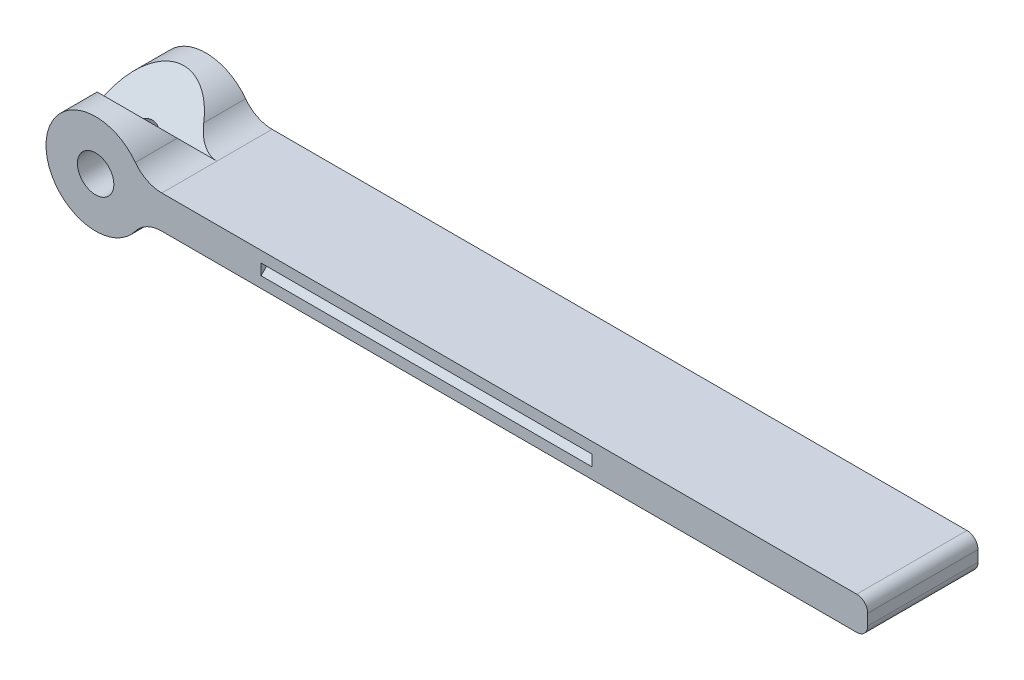
ISO-10303-21;
HEADER;
FILE_DESCRIPTION(('STEP AP214'),'2;1');
FILE_NAME('part.step','',(''),(''),'','','');
FILE_SCHEMA(('AUTOMOTIVE_DESIGN { 1 0 10303 214 1 1 1 1 }'));
ENDSEC;
DATA;
#1=APPLICATION_CONTEXT('core data for automotive mechanical design processes');
#2=APPLICATION_PROTOCOL_DEFINITION('international standard','automotive_design',2000,#1);
#3=PRODUCT_CONTEXT('',#1,'mechanical');
#4=PRODUCT('Part','Part','',(#3));
#5=PRODUCT_RELATED_PRODUCT_CATEGORY('part','',(#4));
#6=PRODUCT_DEFINITION_FORMATION('','',#4);
#7=PRODUCT_DEFINITION_CONTEXT('part definition',#1,'design');
#8=PRODUCT_DEFINITION('design','',#6,#7);
#9=PRODUCT_DEFINITION_SHAPE('','',#8);
#10=(LENGTH_UNIT() NAMED_UNIT(*) SI_UNIT(.MILLI.,.METRE.));
#11=(NAMED_UNIT(*) PLANE_ANGLE_UNIT() SI_UNIT($,.RADIAN.));
#12=(NAMED_UNIT(*) SI_UNIT($,.STERADIAN.) SOLID_ANGLE_UNIT());
#13=UNCERTAINTY_MEASURE_WITH_UNIT(LENGTH_MEASURE(1.E-05),#10,'distance_accuracy_value','');
#14=(GEOMETRIC_REPRESENTATION_CONTEXT(3) GLOBAL_UNCERTAINTY_ASSIGNED_CONTEXT((#13)) GLOBAL_UNIT_ASSIGNED_CONTEXT((#10,
#11,#12)) REPRESENTATION_CONTEXT('',''));
#15=CARTESIAN_POINT('',(0.,0.,0.));
#16=DIRECTION('',(0.,0.,1.));
#17=DIRECTION('',(1.,0.,0.));
#18=AXIS2_PLACEMENT_3D('',#15,#16,#17);
#19=CARTESIAN_POINT('',(-10.9373031220337,6.14016499259442,10.));
#20=DIRECTION('',(0.,0.,1.));
#21=DIRECTION('',(1.,0.,0.));
#22=AXIS2_PLACEMENT_3D('',#19,#20,#21);
#23=PLANE('',#22);
#24=CARTESIAN_POINT('',(-10.9373031220337,6.14016499259442,10.));
#25=DIRECTION('',(0.,0.,-1.));
#26=DIRECTION('',(1.,0.,0.));
#27=AXIS2_PLACEMENT_3D('',#24,#25,#26);
#28=CIRCLE('',#27,3.);
#29=CARTESIAN_POINT('',(-13.3373031220337,7.94016499259442,10.));
#30=VERTEX_POINT('',#29);
#31=CARTESIAN_POINT('',(-10.9373031220337,9.14016499259442,10.));
#32=VERTEX_POINT('',#31);
#33=EDGE_CURVE('E231',#30,#32,#28,.T.);
#34=ORIENTED_EDGE('',*,*,#33,.T.);
#35=DIRECTION('',(1.,0.,0.));
#36=VECTOR('',#35,1.);
#37=CARTESIAN_POINT('',(52.0626968779663,9.14016499259443,10.));
#38=LINE('',#37,#36);
#39=CARTESIAN_POINT('',(52.0626968779663,9.14016499259443,10.));
#40=VERTEX_POINT('',#39);
#41=EDGE_CURVE('E234',#32,#40,#38,.T.);
#42=ORIENTED_EDGE('',*,*,#41,.T.);
#43=CARTESIAN_POINT('',(52.0626968779663,10.1401649925944,10.));
#44=DIRECTION('',(0.,0.,1.));
#45=DIRECTION('',(1.,0.,0.));
#46=AXIS2_PLACEMENT_3D('',#43,#44,#45);
#47=CIRCLE('',#46,1.);
#48=CARTESIAN_POINT('',(53.0626968779663,10.1401649925944,10.));
#49=VERTEX_POINT('',#48);
#50=EDGE_CURVE('E237',#40,#49,#47,.T.);
#51=ORIENTED_EDGE('',*,*,#50,.T.);
#52=DIRECTION('',(0.,1.,0.));
#53=VECTOR('',#52,1.);
#54=CARTESIAN_POINT('',(53.0626968779663,11.1401649925944,10.));
#55=LINE('',#54,#53);
#56=CARTESIAN_POINT('',(53.0626968779663,11.1401649925944,10.));
#57=VERTEX_POINT('',#56);
#58=EDGE_CURVE('E239',#49,#57,#55,.T.);
#59=ORIENTED_EDGE('',*,*,#58,.T.);
#60=CARTESIAN_POINT('',(52.0626968779663,11.1401649925944,10.));
#61=DIRECTION('',(0.,0.,1.));
#62=DIRECTION('',(-1.,0.,0.));
#63=AXIS2_PLACEMENT_3D('',#60,#61,#62);
#64=CIRCLE('',#63,0.999999999999999);
#65=CARTESIAN_POINT('',(52.0626968779663,12.1401649925944,10.));
#66=VERTEX_POINT('',#65);
#67=EDGE_CURVE('E241',#57,#66,#64,.T.);
#68=ORIENTED_EDGE('',*,*,#67,.T.);
#69=DIRECTION('',(-1.,0.,0.));
#70=VECTOR('',#69,1.);
#71=CARTESIAN_POINT('',(-10.9373031220337,12.1401649925944,10.));
#72=LINE('',#71,#70);
#73=CARTESIAN_POINT('',(-10.9373031220337,12.1401649925944,10.));
#74=VERTEX_POINT('',#73);
#75=EDGE_CURVE('E243',#66,#74,#72,.T.);
#76=ORIENTED_EDGE('',*,*,#75,.T.);
#77=CARTESIAN_POINT('',(-10.9373031220337,15.1401649925944,10.));
#78=DIRECTION('',(0.,0.,-1.));
#79=DIRECTION('',(-1.,0.,0.));
#80=AXIS2_PLACEMENT_3D('',#77,#78,#79);
#81=CIRCLE('',#80,3.);
#82=CARTESIAN_POINT('',(-13.3373031220337,13.3401649925944,10.));
#83=VERTEX_POINT('',#82);
#84=EDGE_CURVE('E245',#74,#83,#81,.T.);
#85=ORIENTED_EDGE('',*,*,#84,.T.);
#86=CARTESIAN_POINT('',(-16.9373031220337,10.6401649925944,10.));
#87=DIRECTION('',(0.,0.,1.));
#88=DIRECTION('',(1.,0.,0.));
#89=AXIS2_PLACEMENT_3D('',#86,#87,#88);
#90=CIRCLE('',#89,4.5);
#91=EDGE_CURVE('E247',#83,#30,#90,.T.);
#92=ORIENTED_EDGE('',*,*,#91,.T.);
#93=EDGE_LOOP('',(#34,#42,#51,#59,#68,#76,#85,#92));
#94=FACE_BOUND('',#93,.T.);
#95=CARTESIAN_POINT('',(-16.9373031220337,10.6401649925944,10.));
#96=DIRECTION('',(0.,0.,1.));
#97=DIRECTION('',(1.,0.,0.));
#98=AXIS2_PLACEMENT_3D('',#95,#96,#97);
#99=CIRCLE('',#98,1.65);
#100=CARTESIAN_POINT('',(-15.2873031220337,10.6401649925944,10.));
#101=VERTEX_POINT('',#100);
#102=EDGE_CURVE('E225',#101,#101,#99,.T.);
#103=ORIENTED_EDGE('',*,*,#102,.F.);
#104=EDGE_LOOP('',(#103));
#105=FACE_BOUND('',#104,.T.);
#106=DIRECTION('',(1.,0.,0.));
#107=VECTOR('',#106,1.);
#108=CARTESIAN_POINT('',(-1.9373031220337,10.1401649925944,10.));
#109=LINE('',#108,#107);
#110=CARTESIAN_POINT('',(-1.9373031220337,10.1401649925944,10.));
#111=VERTEX_POINT('',#110);
#112=CARTESIAN_POINT('',(28.0626968779663,10.1401649925944,10.));
#113=VERTEX_POINT('',#112);
#114=EDGE_CURVE('E55',#111,#113,#109,.T.);
#115=ORIENTED_EDGE('',*,*,#114,.F.);
#116=DIRECTION('',(0.,1.,0.));
#117=VECTOR('',#116,1.);
#118=CARTESIAN_POINT('',(-1.9373031220337,11.1401649925944,10.));
#119=LINE('',#118,#117);
#120=CARTESIAN_POINT('',(-1.9373031220337,11.1401649925944,10.));
#121=VERTEX_POINT('',#120);
#122=EDGE_CURVE('E167',#111,#121,#119,.T.);
#123=ORIENTED_EDGE('',*,*,#122,.T.);
#124=DIRECTION('',(1.,0.,0.));
#125=VECTOR('',#124,1.);
#126=CARTESIAN_POINT('',(-1.9373031220337,11.1401649925944,10.));
#127=LINE('',#126,#125);
#128=CARTESIAN_POINT('',(28.0626968779663,11.1401649925944,10.));
#129=VERTEX_POINT('',#128);
#130=EDGE_CURVE('E180',#121,#129,#127,.T.);
#131=ORIENTED_EDGE('',*,*,#130,.T.);
#132=DIRECTION('',(0.,1.,0.));
#133=VECTOR('',#132,1.);
#134=CARTESIAN_POINT('',(28.0626968779663,11.1401649925944,10.));
#135=LINE('',#134,#133);
#136=EDGE_CURVE('E178',#113,#129,#135,.T.);
#137=ORIENTED_EDGE('',*,*,#136,.F.);
#138=EDGE_LOOP('',(#115,#123,#131,#137));
#139=FACE_BOUND('',#138,.T.);
#140=ADVANCED_FACE('F40',(#94,#105,#139),#23,.T.);
#141=CARTESIAN_POINT('',(-10.9373031220337,6.14016499259442,0.));
#142=DIRECTION('',(0.,0.,1.));
#143=DIRECTION('',(1.,0.,0.));
#144=AXIS2_PLACEMENT_3D('',#141,#142,#143);
#145=PLANE('',#144);
#146=CARTESIAN_POINT('',(-16.9373031220337,10.6401649925944,0.));
#147=DIRECTION('',(0.,0.,1.));
#148=DIRECTION('',(1.,0.,0.));
#149=AXIS2_PLACEMENT_3D('',#146,#147,#148);
#150=CIRCLE('',#149,1.65);
#151=CARTESIAN_POINT('',(-15.2873031220337,10.6401649925944,0.));
#152=VERTEX_POINT('',#151);
#153=EDGE_CURVE('E224',#152,#152,#150,.T.);
#154=ORIENTED_EDGE('',*,*,#153,.T.);
#155=EDGE_LOOP('',(#154));
#156=FACE_BOUND('',#155,.T.);
#157=CARTESIAN_POINT('',(-10.9373031220337,6.14016499259442,0.));
#158=DIRECTION('',(0.,0.,-1.));
#159=DIRECTION('',(1.,0.,0.));
#160=AXIS2_PLACEMENT_3D('',#157,#158,#159);
#161=CIRCLE('',#160,3.);
#162=CARTESIAN_POINT('',(-13.3373031220337,7.94016499259442,0.));
#163=VERTEX_POINT('',#162);
#164=CARTESIAN_POINT('',(-10.9373031220337,9.14016499259442,0.));
#165=VERTEX_POINT('',#164);
#166=EDGE_CURVE('E228',#163,#165,#161,.T.);
#167=ORIENTED_EDGE('',*,*,#166,.F.);
#168=CARTESIAN_POINT('',(-16.9373031220337,10.6401649925944,0.));
#169=DIRECTION('',(0.,0.,1.));
#170=DIRECTION('',(1.,0.,0.));
#171=AXIS2_PLACEMENT_3D('',#168,#169,#170);
#172=CIRCLE('',#171,4.5);
#173=CARTESIAN_POINT('',(-13.3373031220337,13.3401649925944,0.));
#174=VERTEX_POINT('',#173);
#175=EDGE_CURVE('E235',#174,#163,#172,.T.);
#176=ORIENTED_EDGE('',*,*,#175,.F.);
#177=CARTESIAN_POINT('',(-10.9373031220337,15.1401649925944,0.));
#178=DIRECTION('',(0.,0.,-1.));
#179=DIRECTION('',(-1.,0.,0.));
#180=AXIS2_PLACEMENT_3D('',#177,#178,#179);
#181=CIRCLE('',#180,3.);
#182=CARTESIAN_POINT('',(-10.9373031220337,12.1401649925944,0.));
#183=VERTEX_POINT('',#182);
#184=EDGE_CURVE('E263',#183,#174,#181,.T.);
#185=ORIENTED_EDGE('',*,*,#184,.F.);
#186=DIRECTION('',(-1.,0.,0.));
#187=VECTOR('',#186,1.);
#188=CARTESIAN_POINT('',(-10.9373031220337,12.1401649925944,0.));
#189=LINE('',#188,#187);
#190=CARTESIAN_POINT('',(52.0626968779663,12.1401649925944,0.));
#191=VERTEX_POINT('',#190);
#192=EDGE_CURVE('E260',#191,#183,#189,.T.);
#193=ORIENTED_EDGE('',*,*,#192,.F.);
#194=CARTESIAN_POINT('',(52.0626968779663,11.1401649925944,0.));
#195=DIRECTION('',(0.,0.,1.));
#196=DIRECTION('',(-1.,0.,0.));
#197=AXIS2_PLACEMENT_3D('',#194,#195,#196);
#198=CIRCLE('',#197,0.999999999999999);
#199=CARTESIAN_POINT('',(53.0626968779663,11.1401649925944,0.));
#200=VERTEX_POINT('',#199);
#201=EDGE_CURVE('E258',#200,#191,#198,.T.);
#202=ORIENTED_EDGE('',*,*,#201,.F.);
#203=DIRECTION('',(0.,1.,0.));
#204=VECTOR('',#203,1.);
#205=CARTESIAN_POINT('',(53.0626968779663,11.1401649925944,0.));
#206=LINE('',#205,#204);
#207=CARTESIAN_POINT('',(53.0626968779663,10.1401649925944,0.));
#208=VERTEX_POINT('',#207);
#209=EDGE_CURVE('E256',#208,#200,#206,.T.);
#210=ORIENTED_EDGE('',*,*,#209,.F.);
#211=CARTESIAN_POINT('',(52.0626968779663,10.1401649925944,0.));
#212=DIRECTION('',(0.,0.,1.));
#213=DIRECTION('',(1.,0.,0.));
#214=AXIS2_PLACEMENT_3D('',#211,#212,#213);
#215=CIRCLE('',#214,1.);
#216=CARTESIAN_POINT('',(52.0626968779663,9.14016499259443,0.));
#217=VERTEX_POINT('',#216);
#218=EDGE_CURVE('E254',#217,#208,#215,.T.);
#219=ORIENTED_EDGE('',*,*,#218,.F.);
#220=DIRECTION('',(1.,0.,0.));
#221=VECTOR('',#220,1.);
#222=CARTESIAN_POINT('',(52.0626968779663,9.14016499259443,0.));
#223=LINE('',#222,#221);
#224=EDGE_CURVE('E252',#165,#217,#223,.T.);
#225=ORIENTED_EDGE('',*,*,#224,.F.);
#226=EDGE_LOOP('',(#167,#176,#185,#193,#202,#210,#219,#225));
#227=FACE_BOUND('',#226,.T.);
#228=DIRECTION('',(0.,1.,0.));
#229=VECTOR('',#228,1.);
#230=CARTESIAN_POINT('',(-1.9373031220337,11.1401649925944,0.));
#231=LINE('',#230,#229);
#232=CARTESIAN_POINT('',(-1.9373031220337,10.1401649925944,0.));
#233=VERTEX_POINT('',#232);
#234=CARTESIAN_POINT('',(-1.9373031220337,11.1401649925944,0.));
#235=VERTEX_POINT('',#234);
#236=EDGE_CURVE('E185',#233,#235,#231,.T.);
#237=ORIENTED_EDGE('',*,*,#236,.F.);
#238=DIRECTION('',(1.,0.,0.));
#239=VECTOR('',#238,1.);
#240=CARTESIAN_POINT('',(-1.9373031220337,10.1401649925944,0.));
#241=LINE('',#240,#239);
#242=CARTESIAN_POINT('',(28.0626968779663,10.1401649925944,0.));
#243=VERTEX_POINT('',#242);
#244=EDGE_CURVE('E202',#233,#243,#241,.T.);
#245=ORIENTED_EDGE('',*,*,#244,.T.);
#246=DIRECTION('',(0.,1.,0.));
#247=VECTOR('',#246,1.);
#248=CARTESIAN_POINT('',(28.0626968779663,11.1401649925944,0.));
#249=LINE('',#248,#247);
#250=CARTESIAN_POINT('',(28.0626968779663,11.1401649925944,0.));
#251=VERTEX_POINT('',#250);
#252=EDGE_CURVE('E196',#243,#251,#249,.T.);
#253=ORIENTED_EDGE('',*,*,#252,.T.);
#254=DIRECTION('',(1.,0.,0.));
#255=VECTOR('',#254,1.);
#256=CARTESIAN_POINT('',(-1.9373031220337,11.1401649925944,0.));
#257=LINE('',#256,#255);
#258=EDGE_CURVE('E195',#235,#251,#257,.T.);
#259=ORIENTED_EDGE('',*,*,#258,.F.);
#260=EDGE_LOOP('',(#237,#245,#253,#259));
#261=FACE_BOUND('',#260,.T.);
#262=ADVANCED_FACE('F309',(#156,#227,#261),#145,.F.);
#263=CARTESIAN_POINT('',(-10.9373031220337,15.1401649925944,10.));
#264=DIRECTION('',(0.,0.,-1.));
#265=DIRECTION('',(-1.,0.,0.));
#266=AXIS2_PLACEMENT_3D('',#263,#264,#265);
#267=CYLINDRICAL_SURFACE('',#266,3.);
#268=DIRECTION('',(0.,0.,-1.));
#269=VECTOR('',#268,1.);
#270=CARTESIAN_POINT('',(-13.3373031220337,13.3401649925944,10.));
#271=LINE('',#270,#269);
#272=CARTESIAN_POINT('',(-13.3373031220337,13.3401649925944,3.80000000000001));
#273=VERTEX_POINT('',#272);
#274=EDGE_CURVE('E269',#273,#174,#271,.T.);
#275=ORIENTED_EDGE('',*,*,#274,.F.);
#276=CARTESIAN_POINT('',(-10.9373031220337,15.1401649925944,2.00000000000003));
#277=DIRECTION('',(0.,-0.707106781186543,-0.707106781186552));
#278=DIRECTION('',(0.,0.707106781186552,-0.707106781186543));
#279=AXIS2_PLACEMENT_3D('',#276,#277,#278);
#280=ELLIPSE('',#279,4.24264068711926,3.);
#281=CARTESIAN_POINT('',(-10.9373031220337,12.1401649925944,5.));
#282=VERTEX_POINT('',#281);
#283=EDGE_CURVE('E221',#273,#282,#280,.F.);
#284=ORIENTED_EDGE('',*,*,#283,.T.);
#285=DIRECTION('',(0.,0.,-1.));
#286=VECTOR('',#285,1.);
#287=CARTESIAN_POINT('',(-10.9373031220337,12.1401649925944,10.));
#288=LINE('',#287,#286);
#289=EDGE_CURVE('E273',#282,#183,#288,.T.);
#290=ORIENTED_EDGE('',*,*,#289,.T.);
#291=ORIENTED_EDGE('',*,*,#184,.T.);
#292=EDGE_LOOP('',(#275,#284,#290,#291));
#293=FACE_BOUND('',#292,.T.);
#294=ADVANCED_FACE('F312',(#293),#267,.F.);
#295=CARTESIAN_POINT('',(-10.9373031220337,6.14016499259442,10.));
#296=DIRECTION('',(0.,0.,-1.));
#297=DIRECTION('',(-1.,0.,0.));
#298=AXIS2_PLACEMENT_3D('',#295,#296,#297);
#299=CYLINDRICAL_SURFACE('',#298,3.);
#300=ORIENTED_EDGE('',*,*,#166,.T.);
#301=DIRECTION('',(0.,0.,-1.));
#302=VECTOR('',#301,1.);
#303=CARTESIAN_POINT('',(-10.9373031220337,9.14016499259442,10.));
#304=LINE('',#303,#302);
#305=EDGE_CURVE('E289',#32,#165,#304,.T.);
#306=ORIENTED_EDGE('',*,*,#305,.F.);
#307=ORIENTED_EDGE('',*,*,#33,.F.);
#308=DIRECTION('',(0.,0.,-1.));
#309=VECTOR('',#308,1.);
#310=CARTESIAN_POINT('',(-13.3373031220337,7.94016499259442,10.));
#311=LINE('',#310,#309);
#312=EDGE_CURVE('E249',#30,#163,#311,.T.);
#313=ORIENTED_EDGE('',*,*,#312,.T.);
#314=EDGE_LOOP('',(#300,#306,#307,#313));
#315=FACE_BOUND('',#314,.T.);
#316=ADVANCED_FACE('F42',(#315),#299,.F.);
#317=CARTESIAN_POINT('',(52.0626968779663,9.14016499259443,10.));
#318=DIRECTION('',(0.,1.,0.));
#319=DIRECTION('',(-1.,0.,0.));
#320=AXIS2_PLACEMENT_3D('',#317,#318,#319);
#321=PLANE('',#320);
#322=ORIENTED_EDGE('',*,*,#224,.T.);
#323=DIRECTION('',(0.,0.,-1.));
#324=VECTOR('',#323,1.);
#325=CARTESIAN_POINT('',(52.0626968779663,9.14016499259443,10.));
#326=LINE('',#325,#324);
#327=EDGE_CURVE('E286',#40,#217,#326,.T.);
#328=ORIENTED_EDGE('',*,*,#327,.F.);
#329=ORIENTED_EDGE('',*,*,#41,.F.);
#330=ORIENTED_EDGE('',*,*,#305,.T.);
#331=EDGE_LOOP('',(#322,#328,#329,#330));
#332=FACE_BOUND('',#331,.T.);
#333=ADVANCED_FACE('F366',(#332),#321,.F.);
#334=CARTESIAN_POINT('',(52.0626968779663,10.1401649925944,10.));
#335=DIRECTION('',(0.,0.,-1.));
#336=DIRECTION('',(-1.,0.,0.));
#337=AXIS2_PLACEMENT_3D('',#334,#335,#336);
#338=CYLINDRICAL_SURFACE('',#337,1.);
#339=ORIENTED_EDGE('',*,*,#218,.T.);
#340=DIRECTION('',(0.,0.,-1.));
#341=VECTOR('',#340,1.);
#342=CARTESIAN_POINT('',(53.0626968779663,10.1401649925944,10.));
#343=LINE('',#342,#341);
#344=EDGE_CURVE('E283',#49,#208,#343,.T.);
#345=ORIENTED_EDGE('',*,*,#344,.F.);
#346=ORIENTED_EDGE('',*,*,#50,.F.);
#347=ORIENTED_EDGE('',*,*,#327,.T.);
#348=EDGE_LOOP('',(#339,#345,#346,#347));
#349=FACE_BOUND('',#348,.T.);
#350=ADVANCED_FACE('F363',(#349),#338,.T.);
#351=CARTESIAN_POINT('',(53.0626968779663,11.1401649925944,10.));
#352=DIRECTION('',(-1.,0.,0.));
#353=DIRECTION('',(0.,0.,1.));
#354=AXIS2_PLACEMENT_3D('',#351,#352,#353);
#355=PLANE('',#354);
#356=ORIENTED_EDGE('',*,*,#209,.T.);
#357=DIRECTION('',(0.,0.,-1.));
#358=VECTOR('',#357,1.);
#359=CARTESIAN_POINT('',(53.0626968779663,11.1401649925944,10.));
#360=LINE('',#359,#358);
#361=EDGE_CURVE('E280',#57,#200,#360,.T.);
#362=ORIENTED_EDGE('',*,*,#361,.F.);
#363=ORIENTED_EDGE('',*,*,#58,.F.);
#364=ORIENTED_EDGE('',*,*,#344,.T.);
#365=EDGE_LOOP('',(#356,#362,#363,#364));
#366=FACE_BOUND('',#365,.T.);
#367=ADVANCED_FACE('F359',(#366),#355,.F.);
#368=CARTESIAN_POINT('',(52.0626968779663,11.1401649925944,10.));
#369=DIRECTION('',(0.,0.,-1.));
#370=DIRECTION('',(-1.,0.,0.));
#371=AXIS2_PLACEMENT_3D('',#368,#369,#370);
#372=CYLINDRICAL_SURFACE('',#371,0.999999999999999);
#373=ORIENTED_EDGE('',*,*,#201,.T.);
#374=DIRECTION('',(0.,0.,-1.));
#375=VECTOR('',#374,1.);
#376=CARTESIAN_POINT('',(52.0626968779663,12.1401649925944,10.));
#377=LINE('',#376,#375);
#378=EDGE_CURVE('E277',#66,#191,#377,.T.);
#379=ORIENTED_EDGE('',*,*,#378,.F.);
#380=ORIENTED_EDGE('',*,*,#67,.F.);
#381=ORIENTED_EDGE('',*,*,#361,.T.);
#382=EDGE_LOOP('',(#373,#379,#380,#381));
#383=FACE_BOUND('',#382,.T.);
#384=ADVANCED_FACE('F355',(#383),#372,.T.);
#385=CARTESIAN_POINT('',(-10.9373031220337,12.1401649925944,10.));
#386=DIRECTION('',(0.,-1.,0.));
#387=DIRECTION('',(1.,0.,0.));
#388=AXIS2_PLACEMENT_3D('',#385,#386,#387);
#389=PLANE('',#388);
#390=ORIENTED_EDGE('',*,*,#289,.F.);
#391=EDGE_CURVE('E274',#74,#282,#288,.T.);
#392=ORIENTED_EDGE('',*,*,#391,.F.);
#393=ORIENTED_EDGE('',*,*,#75,.F.);
#394=ORIENTED_EDGE('',*,*,#378,.T.);
#395=ORIENTED_EDGE('',*,*,#192,.T.);
#396=EDGE_LOOP('',(#390,#392,#393,#394,#395));
#397=FACE_BOUND('',#396,.T.);
#398=ADVANCED_FACE('F351',(#397),#389,.F.);
#399=ORIENTED_EDGE('',*,*,#391,.T.);
#400=CARTESIAN_POINT('',(-10.9373031220337,15.1401649925944,7.99999999999997));
#401=DIRECTION('',(0.,-0.707106781186543,0.707106781186552));
#402=DIRECTION('',(0.,-0.707106781186552,-0.707106781186543));
#403=AXIS2_PLACEMENT_3D('',#400,#401,#402);
#404=ELLIPSE('',#403,4.24264068711926,3.);
#405=CARTESIAN_POINT('',(-13.3373031220337,13.3401649925944,6.19999999999999));
#406=VERTEX_POINT('',#405);
#407=EDGE_CURVE('E215',#282,#406,#404,.F.);
#408=ORIENTED_EDGE('',*,*,#407,.T.);
#409=EDGE_CURVE('E270',#83,#406,#271,.T.);
#410=ORIENTED_EDGE('',*,*,#409,.F.);
#411=ORIENTED_EDGE('',*,*,#84,.F.);
#412=EDGE_LOOP('',(#399,#408,#410,#411));
#413=FACE_BOUND('',#412,.T.);
#414=ADVANCED_FACE('F347',(#413),#267,.F.);
#415=CARTESIAN_POINT('',(-16.9373031220337,10.6401649925944,10.));
#416=DIRECTION('',(0.,0.,-1.));
#417=DIRECTION('',(-1.,0.,0.));
#418=AXIS2_PLACEMENT_3D('',#415,#416,#417);
#419=CYLINDRICAL_SURFACE('',#418,4.5);
#420=CARTESIAN_POINT('',(-16.9373031220337,10.6401649925944,3.50000000000002));
#421=DIRECTION('',(0.,-0.707106781186543,0.707106781186552));
#422=DIRECTION('',(0.,-0.707106781186552,-0.707106781186543));
#423=AXIS2_PLACEMENT_3D('',#420,#421,#422);
#424=ELLIPSE('',#423,6.36396103067889,4.5);
#425=CARTESIAN_POINT('',(-21.179943809153,12.1401649925944,5.));
#426=VERTEX_POINT('',#425);
#427=EDGE_CURVE('E212',#406,#426,#424,.T.);
#428=ORIENTED_EDGE('',*,*,#427,.T.);
#429=CARTESIAN_POINT('',(-16.9373031220337,10.6401649925944,6.49999999999998));
#430=DIRECTION('',(0.,-0.707106781186543,-0.707106781186552));
#431=DIRECTION('',(0.,0.707106781186552,-0.707106781186543));
#432=AXIS2_PLACEMENT_3D('',#429,#430,#431);
#433=ELLIPSE('',#432,6.36396103067889,4.5);
#434=EDGE_CURVE('E218',#426,#273,#433,.T.);
#435=ORIENTED_EDGE('',*,*,#434,.T.);
#436=ORIENTED_EDGE('',*,*,#274,.T.);
#437=ORIENTED_EDGE('',*,*,#175,.T.);
#438=ORIENTED_EDGE('',*,*,#312,.F.);
#439=ORIENTED_EDGE('',*,*,#91,.F.);
#440=ORIENTED_EDGE('',*,*,#409,.T.);
#441=EDGE_LOOP('',(#428,#435,#436,#437,#438,#439,#440));
#442=FACE_BOUND('',#441,.T.);
#443=ADVANCED_FACE('F303',(#442),#419,.T.);
#444=CARTESIAN_POINT('',(-16.9373031220337,10.6401649925944,10.));
#445=DIRECTION('',(0.,0.,-1.));
#446=DIRECTION('',(-1.,0.,0.));
#447=AXIS2_PLACEMENT_3D('',#444,#445,#446);
#448=CYLINDRICAL_SURFACE('',#447,1.65);
#449=CARTESIAN_POINT('',(-16.9373031220337,10.6401649925944,6.49999999999998));
#450=DIRECTION('',(0.,-0.707106781186543,-0.707106781186552));
#451=DIRECTION('',(0.,0.707106781186552,-0.707106781186543));
#452=AXIS2_PLACEMENT_3D('',#449,#450,#451);
#453=ELLIPSE('',#452,2.3334523779156,1.65);
#454=CARTESIAN_POINT('',(-17.6246894762771,12.1401649925944,5.));
#455=VERTEX_POINT('',#454);
#456=CARTESIAN_POINT('',(-16.2499167677903,12.1401649925944,5.));
#457=VERTEX_POINT('',#456);
#458=EDGE_CURVE('E11',#455,#457,#453,.T.);
#459=ORIENTED_EDGE('',*,*,#458,.F.);
#460=CARTESIAN_POINT('',(-16.9373031220337,10.6401649925944,3.50000000000002));
#461=DIRECTION('',(0.,-0.707106781186543,0.707106781186552));
#462=DIRECTION('',(0.,-0.707106781186552,-0.707106781186543));
#463=AXIS2_PLACEMENT_3D('',#460,#461,#462);
#464=ELLIPSE('',#463,2.3334523779156,1.65);
#465=EDGE_CURVE('E48',#457,#455,#464,.T.);
#466=ORIENTED_EDGE('',*,*,#465,.F.);
#467=EDGE_LOOP('',(#459,#466));
#468=FACE_BOUND('',#467,.T.);
#469=ORIENTED_EDGE('',*,*,#102,.T.);
#470=EDGE_LOOP('',(#469));
#471=FACE_BOUND('',#470,.T.);
#472=ORIENTED_EDGE('',*,*,#153,.F.);
#473=EDGE_LOOP('',(#472));
#474=FACE_BOUND('',#473,.T.);
#475=ADVANCED_FACE('F300',(#468,#471,#474),#448,.F.);
#476=CARTESIAN_POINT('',(-29.,12.1401649925944,5.));
#477=DIRECTION('',(0.,-0.707106781186543,-0.707106781186552));
#478=DIRECTION('',(0.,0.707106781186552,-0.707106781186543));
#479=AXIS2_PLACEMENT_3D('',#476,#477,#478);
#480=PLANE('',#479);
#481=ORIENTED_EDGE('',*,*,#434,.F.);
#482=DIRECTION('',(1.,0.,0.));
#483=VECTOR('',#482,1.);
#484=CARTESIAN_POINT('',(-29.,12.1401649925944,5.));
#485=LINE('',#484,#483);
#486=EDGE_CURVE('E211',#426,#455,#485,.T.);
#487=ORIENTED_EDGE('',*,*,#486,.T.);
#488=ORIENTED_EDGE('',*,*,#458,.T.);
#489=EDGE_CURVE('E205',#457,#282,#485,.T.);
#490=ORIENTED_EDGE('',*,*,#489,.T.);
#491=ORIENTED_EDGE('',*,*,#283,.F.);
#492=EDGE_LOOP('',(#481,#487,#488,#490,#491));
#493=FACE_BOUND('',#492,.T.);
#494=ADVANCED_FACE('F299',(#493),#480,.F.);
#495=CARTESIAN_POINT('',(-29.,15.1401649925944,7.99999999999997));
#496=DIRECTION('',(0.,-0.707106781186543,0.707106781186552));
#497=DIRECTION('',(0.,-0.707106781186552,-0.707106781186543));
#498=AXIS2_PLACEMENT_3D('',#495,#496,#497);
#499=PLANE('',#498);
#500=ORIENTED_EDGE('',*,*,#489,.F.);
#501=ORIENTED_EDGE('',*,*,#465,.T.);
#502=ORIENTED_EDGE('',*,*,#486,.F.);
#503=ORIENTED_EDGE('',*,*,#427,.F.);
#504=ORIENTED_EDGE('',*,*,#407,.F.);
#505=EDGE_LOOP('',(#500,#501,#502,#503,#504));
#506=FACE_BOUND('',#505,.T.);
#507=ADVANCED_FACE('F295',(#506),#499,.F.);
#508=CARTESIAN_POINT('',(-1.9373031220337,10.6401649925944,0.500000000000002));
#509=DIRECTION('',(0.,-0.707106781186546,0.707106781186549));
#510=DIRECTION('',(0.,-0.707106781186549,-0.707106781186546));
#511=AXIS2_PLACEMENT_3D('',#508,#509,#510);
#512=PLANE('',#511);
#513=DIRECTION('',(0.,-0.707106781186549,-0.707106781186546));
#514=VECTOR('',#513,1.);
#515=CARTESIAN_POINT('',(28.0626968779663,10.6401649925944,0.500000000000002));
#516=LINE('',#515,#514);
#517=CARTESIAN_POINT('',(28.0626968779663,10.6401649925944,0.500000000000002));
#518=VERTEX_POINT('',#517);
#519=EDGE_CURVE('E189',#518,#243,#516,.T.);
#520=ORIENTED_EDGE('',*,*,#519,.T.);
#521=ORIENTED_EDGE('',*,*,#244,.F.);
#522=DIRECTION('',(0.,-0.707106781186549,-0.707106781186546));
#523=VECTOR('',#522,1.);
#524=CARTESIAN_POINT('',(-1.9373031220337,10.6401649925944,0.500000000000002));
#525=LINE('',#524,#523);
#526=CARTESIAN_POINT('',(-1.9373031220337,10.6401649925944,0.500000000000002));
#527=VERTEX_POINT('',#526);
#528=EDGE_CURVE('E192',#527,#233,#525,.T.);
#529=ORIENTED_EDGE('',*,*,#528,.F.);
#530=DIRECTION('',(1.,0.,0.));
#531=VECTOR('',#530,1.);
#532=CARTESIAN_POINT('',(-1.9373031220337,10.6401649925944,0.500000000000002));
#533=LINE('',#532,#531);
#534=EDGE_CURVE('E206',#527,#518,#533,.T.);
#535=ORIENTED_EDGE('',*,*,#534,.T.);
#536=EDGE_LOOP('',(#520,#521,#529,#535));
#537=FACE_BOUND('',#536,.T.);
#538=ADVANCED_FACE('F323',(#537),#512,.F.);
#539=CARTESIAN_POINT('',(-1.9373031220337,11.1401649925944,0.));
#540=DIRECTION('',(0.,0.707106781186547,0.707106781186547));
#541=DIRECTION('',(0.,-0.707106781186548,0.707106781186548));
#542=AXIS2_PLACEMENT_3D('',#539,#540,#541);
#543=PLANE('',#542);
#544=DIRECTION('',(0.,-0.707106781186548,0.707106781186548));
#545=VECTOR('',#544,1.);
#546=CARTESIAN_POINT('',(28.0626968779663,11.1401649925944,0.));
#547=LINE('',#546,#545);
#548=EDGE_CURVE('E63',#251,#518,#547,.T.);
#549=ORIENTED_EDGE('',*,*,#548,.T.);
#550=ORIENTED_EDGE('',*,*,#534,.F.);
#551=DIRECTION('',(0.,-0.707106781186548,0.707106781186548));
#552=VECTOR('',#551,1.);
#553=CARTESIAN_POINT('',(-1.9373031220337,11.1401649925944,0.));
#554=LINE('',#553,#552);
#555=EDGE_CURVE('E188',#235,#527,#554,.T.);
#556=ORIENTED_EDGE('',*,*,#555,.F.);
#557=ORIENTED_EDGE('',*,*,#258,.T.);
#558=EDGE_LOOP('',(#549,#550,#556,#557));
#559=FACE_BOUND('',#558,.T.);
#560=ADVANCED_FACE('F335',(#559),#543,.F.);
#561=CARTESIAN_POINT('',(-1.9373031220337,0.,0.));
#562=DIRECTION('',(1.,0.,0.));
#563=DIRECTION('',(0.,0.,-1.));
#564=AXIS2_PLACEMENT_3D('',#561,#562,#563);
#565=PLANE('',#564);
#566=ORIENTED_EDGE('',*,*,#236,.T.);
#567=ORIENTED_EDGE('',*,*,#555,.T.);
#568=ORIENTED_EDGE('',*,*,#528,.T.);
#569=EDGE_LOOP('',(#566,#567,#568));
#570=FACE_BOUND('',#569,.T.);
#571=ADVANCED_FACE('F320',(#570),#565,.T.);
#572=CARTESIAN_POINT('',(28.0626968779663,0.,0.));
#573=DIRECTION('',(1.,0.,0.));
#574=DIRECTION('',(0.,0.,-1.));
#575=AXIS2_PLACEMENT_3D('',#572,#573,#574);
#576=PLANE('',#575);
#577=ORIENTED_EDGE('',*,*,#252,.F.);
#578=ORIENTED_EDGE('',*,*,#519,.F.);
#579=ORIENTED_EDGE('',*,*,#548,.F.);
#580=EDGE_LOOP('',(#577,#578,#579));
#581=FACE_BOUND('',#580,.T.);
#582=ADVANCED_FACE('F324',(#581),#576,.F.);
#583=CARTESIAN_POINT('',(-1.9373031220337,11.1401649925944,10.));
#584=DIRECTION('',(0.,-0.707106781186547,0.707106781186547));
#585=DIRECTION('',(0.,-0.707106781186548,-0.707106781186548));
#586=AXIS2_PLACEMENT_3D('',#583,#584,#585);
#587=PLANE('',#586);
#588=DIRECTION('',(0.,-0.707106781186548,-0.707106781186548));
#589=VECTOR('',#588,1.);
#590=CARTESIAN_POINT('',(28.0626968779663,11.1401649925944,10.));
#591=LINE('',#590,#589);
#592=CARTESIAN_POINT('',(28.0626968779663,10.6401649925944,9.5));
#593=VERTEX_POINT('',#592);
#594=EDGE_CURVE('E174',#129,#593,#591,.T.);
#595=ORIENTED_EDGE('',*,*,#594,.F.);
#596=ORIENTED_EDGE('',*,*,#130,.F.);
#597=DIRECTION('',(0.,-0.707106781186548,-0.707106781186548));
#598=VECTOR('',#597,1.);
#599=CARTESIAN_POINT('',(-1.9373031220337,11.1401649925944,10.));
#600=LINE('',#599,#598);
#601=CARTESIAN_POINT('',(-1.9373031220337,10.6401649925944,9.5));
#602=VERTEX_POINT('',#601);
#603=EDGE_CURVE('E166',#121,#602,#600,.T.);
#604=ORIENTED_EDGE('',*,*,#603,.T.);
#605=DIRECTION('',(1.,0.,0.));
#606=VECTOR('',#605,1.);
#607=CARTESIAN_POINT('',(-1.9373031220337,10.6401649925944,9.5));
#608=LINE('',#607,#606);
#609=EDGE_CURVE('E164',#602,#593,#608,.T.);
#610=ORIENTED_EDGE('',*,*,#609,.T.);
#611=EDGE_LOOP('',(#595,#596,#604,#610));
#612=FACE_BOUND('',#611,.T.);
#613=ADVANCED_FACE('F326',(#612),#587,.T.);
#614=CARTESIAN_POINT('',(-1.9373031220337,10.6401649925944,9.5));
#615=DIRECTION('',(0.,0.707106781186546,0.707106781186549));
#616=DIRECTION('',(0.,-0.707106781186549,0.707106781186546));
#617=AXIS2_PLACEMENT_3D('',#614,#615,#616);
#618=PLANE('',#617);
#619=DIRECTION('',(0.,-0.707106781186549,0.707106781186546));
#620=VECTOR('',#619,1.);
#621=CARTESIAN_POINT('',(28.0626968779663,10.6401649925944,9.5));
#622=LINE('',#621,#620);
#623=EDGE_CURVE('E501',#593,#113,#622,.T.);
#624=ORIENTED_EDGE('',*,*,#623,.F.);
#625=ORIENTED_EDGE('',*,*,#609,.F.);
#626=DIRECTION('',(0.,-0.707106781186549,0.707106781186546));
#627=VECTOR('',#626,1.);
#628=CARTESIAN_POINT('',(-1.9373031220337,10.6401649925944,9.5));
#629=LINE('',#628,#627);
#630=EDGE_CURVE('E160',#602,#111,#629,.T.);
#631=ORIENTED_EDGE('',*,*,#630,.T.);
#632=ORIENTED_EDGE('',*,*,#114,.T.);
#633=EDGE_LOOP('',(#624,#625,#631,#632));
#634=FACE_BOUND('',#633,.T.);
#635=ADVANCED_FACE('F162',(#634),#618,.T.);
#636=CARTESIAN_POINT('',(-1.9373031220337,0.,10.));
#637=DIRECTION('',(1.,0.,0.));
#638=DIRECTION('',(0.,0.,1.));
#639=AXIS2_PLACEMENT_3D('',#636,#637,#638);
#640=PLANE('',#639);
#641=ORIENTED_EDGE('',*,*,#122,.F.);
#642=ORIENTED_EDGE('',*,*,#630,.F.);
#643=ORIENTED_EDGE('',*,*,#603,.F.);
#644=EDGE_LOOP('',(#641,#642,#643));
#645=FACE_BOUND('',#644,.T.);
#646=ADVANCED_FACE('F170',(#645),#640,.T.);
#647=CARTESIAN_POINT('',(28.0626968779663,0.,10.));
#648=DIRECTION('',(1.,0.,0.));
#649=DIRECTION('',(0.,0.,1.));
#650=AXIS2_PLACEMENT_3D('',#647,#648,#649);
#651=PLANE('',#650);
#652=ORIENTED_EDGE('',*,*,#136,.T.);
#653=ORIENTED_EDGE('',*,*,#594,.T.);
#654=ORIENTED_EDGE('',*,*,#623,.T.);
#655=EDGE_LOOP('',(#652,#653,#654));
#656=FACE_BOUND('',#655,.T.);
#657=ADVANCED_FACE('F489',(#656),#651,.F.);
#658=CLOSED_SHELL('',(#140,#262,#294,#316,#333,#350,#367,#384,#398,#414,#443,#475,#494,#507,
#538,#560,#571,#582,#613,#635,#646,#657));
#659=MANIFOLD_SOLID_BREP('B2',#658);
#660=ADVANCED_BREP_SHAPE_REPRESENTATION('',(#18,#659),#14);
#661=SHAPE_DEFINITION_REPRESENTATION(#9,#660);
ENDSEC;
END-ISO-10303-21;
